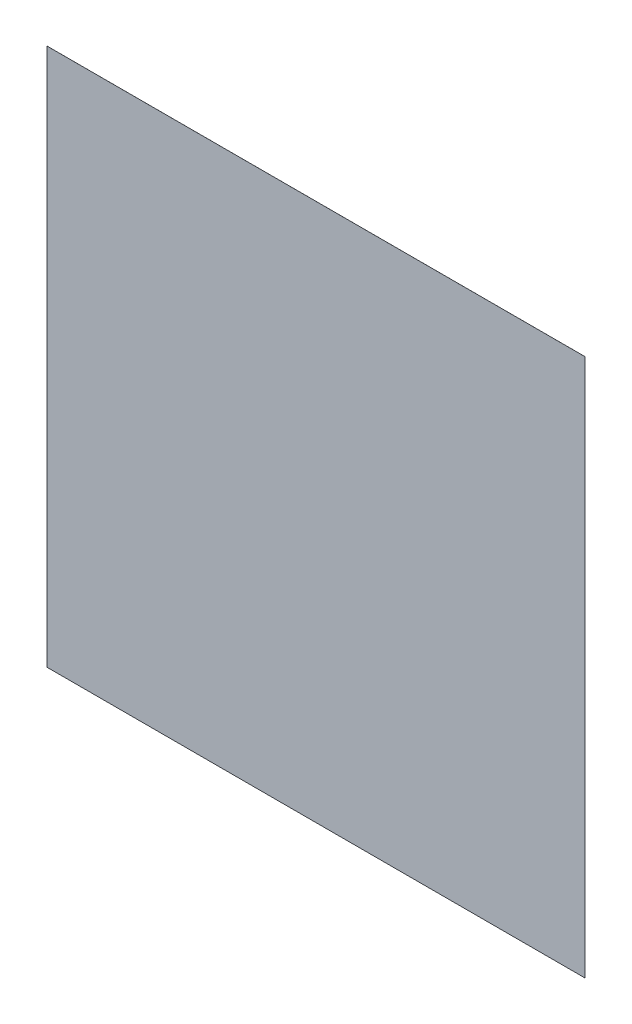
ISO-10303-21;
HEADER;
FILE_DESCRIPTION(('STEP AP214'),'2;1');
FILE_NAME('part.step','',(''),(''),'','','');
FILE_SCHEMA(('AUTOMOTIVE_DESIGN { 1 0 10303 214 1 1 1 1 }'));
ENDSEC;
DATA;
#1=APPLICATION_CONTEXT('core data for automotive mechanical design processes');
#2=APPLICATION_PROTOCOL_DEFINITION('international standard','automotive_design',2000,#1);
#3=PRODUCT_CONTEXT('',#1,'mechanical');
#4=PRODUCT('Part','Part','',(#3));
#5=PRODUCT_RELATED_PRODUCT_CATEGORY('part','',(#4));
#6=PRODUCT_DEFINITION_FORMATION('','',#4);
#7=PRODUCT_DEFINITION_CONTEXT('part definition',#1,'design');
#8=PRODUCT_DEFINITION('design','',#6,#7);
#9=PRODUCT_DEFINITION_SHAPE('','',#8);
#10=(LENGTH_UNIT() NAMED_UNIT(*) SI_UNIT(.MILLI.,.METRE.));
#11=(NAMED_UNIT(*) PLANE_ANGLE_UNIT() SI_UNIT($,.RADIAN.));
#12=(NAMED_UNIT(*) SI_UNIT($,.STERADIAN.) SOLID_ANGLE_UNIT());
#13=UNCERTAINTY_MEASURE_WITH_UNIT(LENGTH_MEASURE(1.E-05),#10,'distance_accuracy_value','');
#14=(GEOMETRIC_REPRESENTATION_CONTEXT(3) GLOBAL_UNCERTAINTY_ASSIGNED_CONTEXT((#13)) GLOBAL_UNIT_ASSIGNED_CONTEXT((#10,
#11,#12)) REPRESENTATION_CONTEXT('',''));
#15=CARTESIAN_POINT('',(0.,0.,0.));
#16=DIRECTION('',(0.,0.,1.));
#17=DIRECTION('',(1.,0.,0.));
#18=AXIS2_PLACEMENT_3D('',#15,#16,#17);
#19=CARTESIAN_POINT('',(-0.02499868,0.02500376,0.));
#20=DIRECTION('',(0.,1.,0.));
#21=DIRECTION('',(1.,0.,0.));
#22=AXIS2_PLACEMENT_3D('',#19,#20,#21);
#23=PLANE('',#22);
#24=DIRECTION('',(0.,0.,1.));
#25=VECTOR('',#24,1.);
#26=CARTESIAN_POINT('',(-0.02499868,0.02500376,0.));
#27=LINE('',#26,#25);
#28=CARTESIAN_POINT('',(-0.02499868,0.02500376,0.));
#29=VERTEX_POINT('',#28);
#30=CARTESIAN_POINT('',(-0.02499868,0.02500376,2.54E-06));
#31=VERTEX_POINT('',#30);
#32=EDGE_CURVE('E11',#29,#31,#27,.T.);
#33=ORIENTED_EDGE('',*,*,#32,.T.);
#34=DIRECTION('',(1.,0.,0.));
#35=VECTOR('',#34,1.);
#36=CARTESIAN_POINT('',(-0.02499868,0.02500376,2.54E-06));
#37=LINE('',#36,#35);
#38=CARTESIAN_POINT('',(0.02499868,0.02500376,2.54E-06));
#39=VERTEX_POINT('',#38);
#40=EDGE_CURVE('E24',#31,#39,#37,.T.);
#41=ORIENTED_EDGE('',*,*,#40,.T.);
#42=DIRECTION('',(0.,0.,1.));
#43=VECTOR('',#42,1.);
#44=CARTESIAN_POINT('',(0.02499868,0.02500376,0.));
#45=LINE('',#44,#43);
#46=CARTESIAN_POINT('',(0.02499868,0.02500376,0.));
#47=VERTEX_POINT('',#46);
#48=EDGE_CURVE('E85',#47,#39,#45,.T.);
#49=ORIENTED_EDGE('',*,*,#48,.F.);
#50=DIRECTION('',(1.,0.,0.));
#51=VECTOR('',#50,1.);
#52=CARTESIAN_POINT('',(-0.02499868,0.02500376,0.));
#53=LINE('',#52,#51);
#54=EDGE_CURVE('E83',#29,#47,#53,.T.);
#55=ORIENTED_EDGE('',*,*,#54,.F.);
#56=EDGE_LOOP('',(#33,#41,#49,#55));
#57=FACE_BOUND('',#56,.T.);
#58=ADVANCED_FACE('F17',(#57),#23,.T.);
#59=CARTESIAN_POINT('',(0.02499868,0.02500376,0.));
#60=DIRECTION('',(1.,0.,0.));
#61=DIRECTION('',(0.,-1.,0.));
#62=AXIS2_PLACEMENT_3D('',#59,#60,#61);
#63=PLANE('',#62);
#64=ORIENTED_EDGE('',*,*,#48,.T.);
#65=DIRECTION('',(0.,-1.,0.));
#66=VECTOR('',#65,1.);
#67=CARTESIAN_POINT('',(0.02499868,0.02500376,2.54E-06));
#68=LINE('',#67,#66);
#69=CARTESIAN_POINT('',(0.02499868,-0.02500376,2.54E-06));
#70=VERTEX_POINT('',#69);
#71=EDGE_CURVE('E81',#39,#70,#68,.T.);
#72=ORIENTED_EDGE('',*,*,#71,.T.);
#73=DIRECTION('',(0.,0.,1.));
#74=VECTOR('',#73,1.);
#75=CARTESIAN_POINT('',(0.02499868,-0.02500376,0.));
#76=LINE('',#75,#74);
#77=CARTESIAN_POINT('',(0.02499868,-0.02500376,0.));
#78=VERTEX_POINT('',#77);
#79=EDGE_CURVE('E79',#78,#70,#76,.T.);
#80=ORIENTED_EDGE('',*,*,#79,.F.);
#81=DIRECTION('',(0.,-1.,0.));
#82=VECTOR('',#81,1.);
#83=CARTESIAN_POINT('',(0.02499868,0.02500376,0.));
#84=LINE('',#83,#82);
#85=EDGE_CURVE('E70',#47,#78,#84,.T.);
#86=ORIENTED_EDGE('',*,*,#85,.F.);
#87=EDGE_LOOP('',(#64,#72,#80,#86));
#88=FACE_BOUND('',#87,.T.);
#89=ADVANCED_FACE('F90',(#88),#63,.T.);
#90=CARTESIAN_POINT('',(0.02499868,-0.02500376,0.));
#91=DIRECTION('',(-0.000203210725330639,-0.999999979352701,0.));
#92=DIRECTION('',(-0.999999979352701,0.000203210725330639,0.));
#93=AXIS2_PLACEMENT_3D('',#90,#91,#92);
#94=PLANE('',#93);
#95=ORIENTED_EDGE('',*,*,#79,.T.);
#96=DIRECTION('',(-0.999999979352701,0.000203210725330639,0.));
#97=VECTOR('',#96,1.);
#98=CARTESIAN_POINT('',(0.02499868,-0.02500376,2.54E-06));
#99=LINE('',#98,#97);
#100=CARTESIAN_POINT('',(-0.02499868,-0.0249936,2.54E-06));
#101=VERTEX_POINT('',#100);
#102=EDGE_CURVE('E60',#70,#101,#99,.T.);
#103=ORIENTED_EDGE('',*,*,#102,.T.);
#104=DIRECTION('',(0.,0.,1.));
#105=VECTOR('',#104,1.);
#106=CARTESIAN_POINT('',(-0.02499868,-0.0249936,0.));
#107=LINE('',#106,#105);
#108=CARTESIAN_POINT('',(-0.02499868,-0.0249936,0.));
#109=VERTEX_POINT('',#108);
#110=EDGE_CURVE('E54',#109,#101,#107,.T.);
#111=ORIENTED_EDGE('',*,*,#110,.F.);
#112=DIRECTION('',(-0.999999979352701,0.000203210725330639,0.));
#113=VECTOR('',#112,1.);
#114=CARTESIAN_POINT('',(0.02499868,-0.02500376,0.));
#115=LINE('',#114,#113);
#116=EDGE_CURVE('E58',#78,#109,#115,.T.);
#117=ORIENTED_EDGE('',*,*,#116,.F.);
#118=EDGE_LOOP('',(#95,#103,#111,#117));
#119=FACE_BOUND('',#118,.T.);
#120=ADVANCED_FACE('F57',(#119),#94,.T.);
#121=CARTESIAN_POINT('',(-0.02499868,-0.0249936,0.));
#122=DIRECTION('',(-1.,0.,0.));
#123=DIRECTION('',(0.,1.,0.));
#124=AXIS2_PLACEMENT_3D('',#121,#122,#123);
#125=PLANE('',#124);
#126=ORIENTED_EDGE('',*,*,#110,.T.);
#127=DIRECTION('',(0.,1.,0.));
#128=VECTOR('',#127,1.);
#129=CARTESIAN_POINT('',(-0.02499868,-0.0249936,2.54E-06));
#130=LINE('',#129,#128);
#131=EDGE_CURVE('E71',#101,#31,#130,.T.);
#132=ORIENTED_EDGE('',*,*,#131,.T.);
#133=ORIENTED_EDGE('',*,*,#32,.F.);
#134=DIRECTION('',(0.,1.,0.));
#135=VECTOR('',#134,1.);
#136=CARTESIAN_POINT('',(-0.02499868,-0.0249936,0.));
#137=LINE('',#136,#135);
#138=EDGE_CURVE('E68',#109,#29,#137,.T.);
#139=ORIENTED_EDGE('',*,*,#138,.F.);
#140=EDGE_LOOP('',(#126,#132,#133,#139));
#141=FACE_BOUND('',#140,.T.);
#142=ADVANCED_FACE('F73',(#141),#125,.T.);
#143=CARTESIAN_POINT('',(-0.02499868,0.02500376,0.));
#144=DIRECTION('',(0.,0.,1.));
#145=DIRECTION('',(1.,0.,0.));
#146=AXIS2_PLACEMENT_3D('',#143,#144,#145);
#147=PLANE('',#146);
#148=ORIENTED_EDGE('',*,*,#54,.T.);
#149=ORIENTED_EDGE('',*,*,#85,.T.);
#150=ORIENTED_EDGE('',*,*,#116,.T.);
#151=ORIENTED_EDGE('',*,*,#138,.T.);
#152=EDGE_LOOP('',(#148,#149,#150,#151));
#153=FACE_BOUND('',#152,.T.);
#154=ADVANCED_FACE('F67',(#153),#147,.F.);
#155=CARTESIAN_POINT('',(-0.02499868,0.02500376,2.54E-06));
#156=DIRECTION('',(0.,0.,1.));
#157=DIRECTION('',(1.,0.,0.));
#158=AXIS2_PLACEMENT_3D('',#155,#156,#157);
#159=PLANE('',#158);
#160=ORIENTED_EDGE('',*,*,#131,.F.);
#161=ORIENTED_EDGE('',*,*,#102,.F.);
#162=ORIENTED_EDGE('',*,*,#71,.F.);
#163=ORIENTED_EDGE('',*,*,#40,.F.);
#164=EDGE_LOOP('',(#160,#161,#162,#163));
#165=FACE_BOUND('',#164,.T.);
#166=ADVANCED_FACE('F91',(#165),#159,.T.);
#167=CLOSED_SHELL('',(#58,#89,#120,#142,#154,#166));
#168=MANIFOLD_SOLID_BREP('B1',#167);
#169=ADVANCED_BREP_SHAPE_REPRESENTATION('',(#18,#168),#14);
#170=SHAPE_DEFINITION_REPRESENTATION(#9,#169);
ENDSEC;
END-ISO-10303-21;
